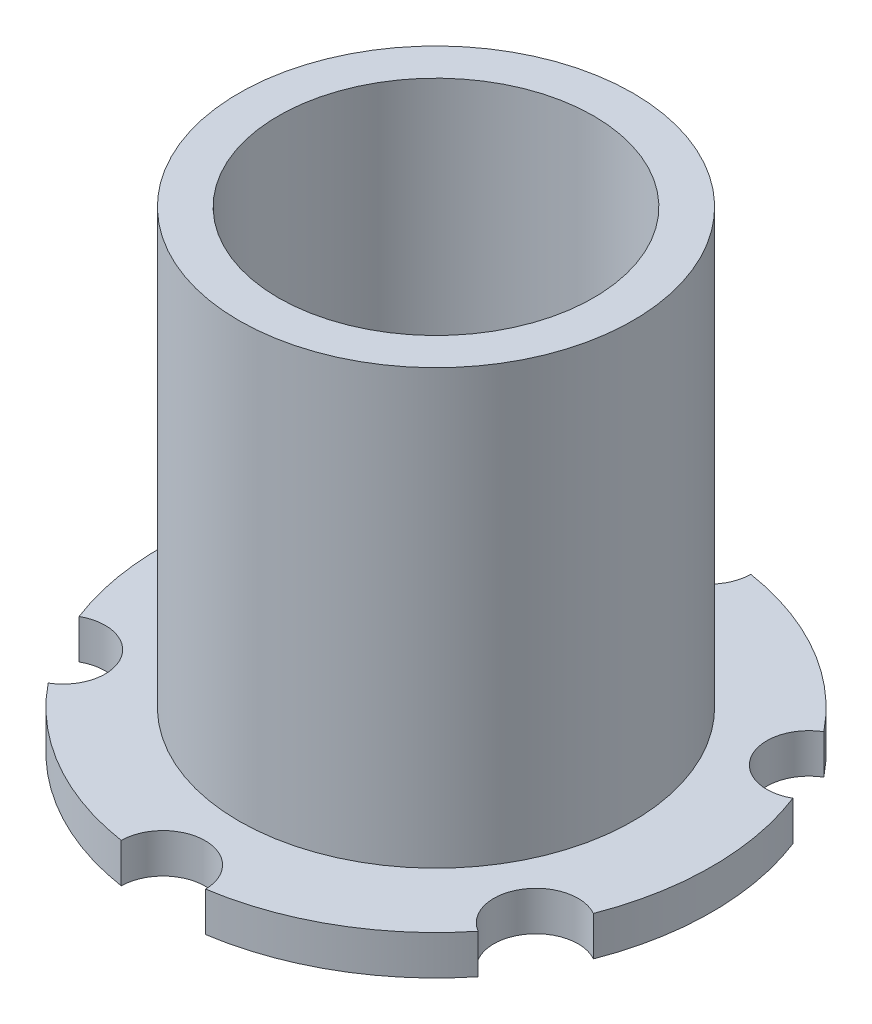
ISO-10303-21;
HEADER;
FILE_DESCRIPTION(('STEP AP214'),'2;1');
FILE_NAME('part.step','',(''),(''),'','','');
FILE_SCHEMA(('AUTOMOTIVE_DESIGN { 1 0 10303 214 1 1 1 1 }'));
ENDSEC;
DATA;
#1=APPLICATION_CONTEXT('core data for automotive mechanical design processes');
#2=APPLICATION_PROTOCOL_DEFINITION('international standard','automotive_design',2000,#1);
#3=PRODUCT_CONTEXT('',#1,'mechanical');
#4=PRODUCT('Part','Part','',(#3));
#5=PRODUCT_RELATED_PRODUCT_CATEGORY('part','',(#4));
#6=PRODUCT_DEFINITION_FORMATION('','',#4);
#7=PRODUCT_DEFINITION_CONTEXT('part definition',#1,'design');
#8=PRODUCT_DEFINITION('design','',#6,#7);
#9=PRODUCT_DEFINITION_SHAPE('','',#8);
#10=(LENGTH_UNIT() NAMED_UNIT(*) SI_UNIT(.MILLI.,.METRE.));
#11=(NAMED_UNIT(*) PLANE_ANGLE_UNIT() SI_UNIT($,.RADIAN.));
#12=(NAMED_UNIT(*) SI_UNIT($,.STERADIAN.) SOLID_ANGLE_UNIT());
#13=UNCERTAINTY_MEASURE_WITH_UNIT(LENGTH_MEASURE(1.E-05),#10,'distance_accuracy_value','');
#14=(GEOMETRIC_REPRESENTATION_CONTEXT(3) GLOBAL_UNCERTAINTY_ASSIGNED_CONTEXT((#13)) GLOBAL_UNIT_ASSIGNED_CONTEXT((#10,
#11,#12)) REPRESENTATION_CONTEXT('',''));
#15=CARTESIAN_POINT('',(0.,0.,0.));
#16=DIRECTION('',(0.,0.,1.));
#17=DIRECTION('',(1.,0.,0.));
#18=AXIS2_PLACEMENT_3D('',#15,#16,#17);
#19=CARTESIAN_POINT('',(0.,1.5875,0.));
#20=DIRECTION('',(0.,-1.,0.));
#21=DIRECTION('',(0.,0.,-1.));
#22=AXIS2_PLACEMENT_3D('',#19,#20,#21);
#23=CYLINDRICAL_SURFACE('',#22,11.1125);
#24=CARTESIAN_POINT('',(0.,0.,0.));
#25=DIRECTION('',(0.,1.,0.));
#26=DIRECTION('',(0.,0.,1.));
#27=AXIS2_PLACEMENT_3D('',#24,#25,#26);
#28=CIRCLE('',#27,11.1125);
#29=CARTESIAN_POINT('',(1.69990162543925,0.,10.9817116477273));
#30=VERTEX_POINT('',#29);
#31=CARTESIAN_POINT('',(8.66049045124758,0.,6.96301381542859));
#32=VERTEX_POINT('',#31);
#33=EDGE_CURVE('E130',#30,#32,#28,.T.);
#34=ORIENTED_EDGE('',*,*,#33,.T.);
#35=DIRECTION('',(0.,-1.,0.));
#36=VECTOR('',#35,1.);
#37=CARTESIAN_POINT('',(8.66049045124758,9.52500000000001,6.96301381542859));
#38=LINE('',#37,#36);
#39=CARTESIAN_POINT('',(8.66049045124758,1.5875,6.96301381542859));
#40=VERTEX_POINT('',#39);
#41=EDGE_CURVE('E11',#32,#40,#38,.F.);
#42=ORIENTED_EDGE('',*,*,#41,.T.);
#43=CARTESIAN_POINT('',(0.,1.5875,0.));
#44=DIRECTION('',(0.,1.,0.));
#45=DIRECTION('',(0.,0.,1.));
#46=AXIS2_PLACEMENT_3D('',#43,#44,#45);
#47=CIRCLE('',#46,11.1125);
#48=CARTESIAN_POINT('',(1.69990162543925,1.5875,10.9817116477273));
#49=VERTEX_POINT('',#48);
#50=EDGE_CURVE('E140',#49,#40,#47,.T.);
#51=ORIENTED_EDGE('',*,*,#50,.F.);
#52=DIRECTION('',(0.,-1.,0.));
#53=VECTOR('',#52,1.);
#54=CARTESIAN_POINT('',(1.69990162543925,9.52500000000001,10.9817116477273));
#55=LINE('',#54,#53);
#56=EDGE_CURVE('E134',#49,#30,#55,.T.);
#57=ORIENTED_EDGE('',*,*,#56,.T.);
#58=EDGE_LOOP('',(#34,#42,#51,#57));
#59=FACE_BOUND('',#58,.T.);
#60=ADVANCED_FACE('F32',(#59),#23,.T.);
#61=CARTESIAN_POINT('',(10.3603920766869,1.5875,4.01869783229891));
#62=VERTEX_POINT('',#61);
#63=CARTESIAN_POINT('',(10.360392076687,1.5875,-4.01869783229869));
#64=VERTEX_POINT('',#63);
#65=EDGE_CURVE('E161',#62,#64,#47,.T.);
#66=ORIENTED_EDGE('',*,*,#65,.F.);
#67=DIRECTION('',(0.,-1.,0.));
#68=VECTOR('',#67,1.);
#69=CARTESIAN_POINT('',(10.3603920766869,9.52500000000001,4.01869783229891));
#70=LINE('',#69,#68);
#71=CARTESIAN_POINT('',(10.3603920766869,0.,4.01869783229891));
#72=VERTEX_POINT('',#71);
#73=EDGE_CURVE('E40',#62,#72,#70,.T.);
#74=ORIENTED_EDGE('',*,*,#73,.T.);
#75=CARTESIAN_POINT('',(10.360392076687,0.,-4.01869783229869));
#76=VERTEX_POINT('',#75);
#77=EDGE_CURVE('E54',#72,#76,#28,.T.);
#78=ORIENTED_EDGE('',*,*,#77,.T.);
#79=DIRECTION('',(0.,-1.,0.));
#80=VECTOR('',#79,1.);
#81=CARTESIAN_POINT('',(10.360392076687,9.52500000000001,-4.01869783229869));
#82=LINE('',#81,#80);
#83=EDGE_CURVE('E214',#76,#64,#82,.F.);
#84=ORIENTED_EDGE('',*,*,#83,.T.);
#85=EDGE_LOOP('',(#66,#74,#78,#84));
#86=FACE_BOUND('',#85,.T.);
#87=ADVANCED_FACE('F206',(#86),#23,.T.);
#88=CARTESIAN_POINT('',(0.,0.,0.));
#89=DIRECTION('',(0.,1.,0.));
#90=DIRECTION('',(0.,0.,1.));
#91=AXIS2_PLACEMENT_3D('',#88,#89,#90);
#92=PLANE('',#91);
#93=CARTESIAN_POINT('',(0.,0.,0.));
#94=DIRECTION('',(0.,1.,0.));
#95=DIRECTION('',(0.,0.,1.));
#96=AXIS2_PLACEMENT_3D('',#93,#94,#95);
#97=CIRCLE('',#96,6.35);
#98=CARTESIAN_POINT('',(0.,0.,6.35));
#99=VERTEX_POINT('',#98);
#100=EDGE_CURVE('E160',#99,#99,#97,.T.);
#101=ORIENTED_EDGE('',*,*,#100,.T.);
#102=EDGE_LOOP('',(#101));
#103=FACE_BOUND('',#102,.T.);
#104=ORIENTED_EDGE('',*,*,#77,.F.);
#105=CARTESIAN_POINT('',(9.52627944162876,0.,5.50000000000011));
#106=DIRECTION('',(0.,-1.,0.));
#107=DIRECTION('',(0.,0.,-1.));
#108=AXIS2_PLACEMENT_3D('',#105,#106,#107);
#109=CIRCLE('',#108,1.69999999999996);
#110=EDGE_CURVE('E47',#32,#72,#109,.T.);
#111=ORIENTED_EDGE('',*,*,#110,.F.);
#112=ORIENTED_EDGE('',*,*,#33,.F.);
#113=CARTESIAN_POINT('',(0.,0.,11.));
#114=DIRECTION('',(0.,-1.,0.));
#115=DIRECTION('',(0.,0.,-1.));
#116=AXIS2_PLACEMENT_3D('',#113,#114,#115);
#117=CIRCLE('',#116,1.69999999999996);
#118=CARTESIAN_POINT('',(-1.69990162543925,0.,10.9817116477273));
#119=VERTEX_POINT('',#118);
#120=EDGE_CURVE('E157',#119,#30,#117,.T.);
#121=ORIENTED_EDGE('',*,*,#120,.F.);
#122=CARTESIAN_POINT('',(-8.66049045124768,0.,6.96301381542847));
#123=VERTEX_POINT('',#122);
#124=EDGE_CURVE('E137',#123,#119,#28,.T.);
#125=ORIENTED_EDGE('',*,*,#124,.F.);
#126=CARTESIAN_POINT('',(-9.52627944162884,0.,5.49999999999998));
#127=DIRECTION('',(0.,-1.,0.));
#128=DIRECTION('',(0.,0.,-1.));
#129=AXIS2_PLACEMENT_3D('',#126,#127,#128);
#130=CIRCLE('',#129,1.69999999999996);
#131=CARTESIAN_POINT('',(-10.3603920766869,0.,4.01869783229876));
#132=VERTEX_POINT('',#131);
#133=EDGE_CURVE('E195',#132,#123,#130,.T.);
#134=ORIENTED_EDGE('',*,*,#133,.F.);
#135=CARTESIAN_POINT('',(-10.3603920766869,0.,-4.01869783229883));
#136=VERTEX_POINT('',#135);
#137=EDGE_CURVE('E143',#136,#132,#28,.T.);
#138=ORIENTED_EDGE('',*,*,#137,.F.);
#139=CARTESIAN_POINT('',(-9.5262794416288,0.,-5.50000000000004));
#140=DIRECTION('',(0.,-1.,0.));
#141=DIRECTION('',(0.,0.,-1.));
#142=AXIS2_PLACEMENT_3D('',#139,#140,#141);
#143=CIRCLE('',#142,1.69999999999996);
#144=CARTESIAN_POINT('',(-8.66049045124763,0.,-6.96301381542853));
#145=VERTEX_POINT('',#144);
#146=EDGE_CURVE('E226',#145,#136,#143,.T.);
#147=ORIENTED_EDGE('',*,*,#146,.F.);
#148=CARTESIAN_POINT('',(-1.69990162543925,0.,-10.9817116477273));
#149=VERTEX_POINT('',#148);
#150=EDGE_CURVE('E150',#149,#145,#28,.T.);
#151=ORIENTED_EDGE('',*,*,#150,.F.);
#152=CARTESIAN_POINT('',(0.,0.,-11.));
#153=DIRECTION('',(0.,-1.,0.));
#154=DIRECTION('',(0.,0.,-1.));
#155=AXIS2_PLACEMENT_3D('',#152,#153,#154);
#156=CIRCLE('',#155,1.69999999999996);
#157=CARTESIAN_POINT('',(1.69990162543925,0.,-10.9817116477273));
#158=VERTEX_POINT('',#157);
#159=EDGE_CURVE('E216',#158,#149,#156,.T.);
#160=ORIENTED_EDGE('',*,*,#159,.F.);
#161=CARTESIAN_POINT('',(8.66049045124773,0.,-6.96301381542841));
#162=VERTEX_POINT('',#161);
#163=EDGE_CURVE('E141',#162,#158,#28,.T.);
#164=ORIENTED_EDGE('',*,*,#163,.F.);
#165=CARTESIAN_POINT('',(9.52627944162887,0.,-5.49999999999991));
#166=DIRECTION('',(0.,-1.,0.));
#167=DIRECTION('',(0.,0.,-1.));
#168=AXIS2_PLACEMENT_3D('',#165,#166,#167);
#169=CIRCLE('',#168,1.69999999999996);
#170=EDGE_CURVE('E207',#76,#162,#169,.T.);
#171=ORIENTED_EDGE('',*,*,#170,.F.);
#172=EDGE_LOOP('',(#104,#111,#112,#121,#125,#134,#138,#147,#151,#160,#164,#171));
#173=FACE_BOUND('',#172,.T.);
#174=ADVANCED_FACE('F128',(#103,#173),#92,.F.);
#175=CARTESIAN_POINT('',(8.66049045124773,1.5875,-6.96301381542841));
#176=VERTEX_POINT('',#175);
#177=CARTESIAN_POINT('',(1.69990162543925,1.5875,-10.9817116477273));
#178=VERTEX_POINT('',#177);
#179=EDGE_CURVE('E167',#176,#178,#47,.T.);
#180=ORIENTED_EDGE('',*,*,#179,.F.);
#181=DIRECTION('',(0.,-1.,0.));
#182=VECTOR('',#181,1.);
#183=CARTESIAN_POINT('',(8.66049045124773,9.52500000000001,-6.96301381542841));
#184=LINE('',#183,#182);
#185=EDGE_CURVE('E209',#176,#162,#184,.T.);
#186=ORIENTED_EDGE('',*,*,#185,.T.);
#187=ORIENTED_EDGE('',*,*,#163,.T.);
#188=DIRECTION('',(0.,-1.,0.));
#189=VECTOR('',#188,1.);
#190=CARTESIAN_POINT('',(1.69990162543925,9.52500000000001,-10.9817116477273));
#191=LINE('',#190,#189);
#192=EDGE_CURVE('E223',#158,#178,#191,.F.);
#193=ORIENTED_EDGE('',*,*,#192,.T.);
#194=EDGE_LOOP('',(#180,#186,#187,#193));
#195=FACE_BOUND('',#194,.T.);
#196=ADVANCED_FACE('F263',(#195),#23,.T.);
#197=CARTESIAN_POINT('',(-1.69990162543925,1.5875,-10.9817116477273));
#198=VERTEX_POINT('',#197);
#199=CARTESIAN_POINT('',(-8.66049045124763,1.5875,-6.96301381542853));
#200=VERTEX_POINT('',#199);
#201=EDGE_CURVE('E171',#198,#200,#47,.T.);
#202=ORIENTED_EDGE('',*,*,#201,.F.);
#203=DIRECTION('',(0.,-1.,0.));
#204=VECTOR('',#203,1.);
#205=CARTESIAN_POINT('',(-1.69990162543925,9.52500000000001,-10.9817116477273));
#206=LINE('',#205,#204);
#207=EDGE_CURVE('E220',#198,#149,#206,.T.);
#208=ORIENTED_EDGE('',*,*,#207,.T.);
#209=ORIENTED_EDGE('',*,*,#150,.T.);
#210=DIRECTION('',(0.,-1.,0.));
#211=VECTOR('',#210,1.);
#212=CARTESIAN_POINT('',(-8.66049045124763,9.52500000000001,-6.96301381542853));
#213=LINE('',#212,#211);
#214=EDGE_CURVE('E230',#145,#200,#213,.F.);
#215=ORIENTED_EDGE('',*,*,#214,.T.);
#216=EDGE_LOOP('',(#202,#208,#209,#215));
#217=FACE_BOUND('',#216,.T.);
#218=ADVANCED_FACE('F255',(#217),#23,.T.);
#219=CARTESIAN_POINT('',(-10.3603920766869,1.5875,-4.01869783229883));
#220=VERTEX_POINT('',#219);
#221=CARTESIAN_POINT('',(-10.3603920766869,1.5875,4.01869783229876));
#222=VERTEX_POINT('',#221);
#223=EDGE_CURVE('E138',#220,#222,#47,.T.);
#224=ORIENTED_EDGE('',*,*,#223,.F.);
#225=DIRECTION('',(0.,-1.,0.));
#226=VECTOR('',#225,1.);
#227=CARTESIAN_POINT('',(-10.3603920766869,9.52500000000001,-4.01869783229883));
#228=LINE('',#227,#226);
#229=EDGE_CURVE('E228',#220,#136,#228,.T.);
#230=ORIENTED_EDGE('',*,*,#229,.T.);
#231=ORIENTED_EDGE('',*,*,#137,.T.);
#232=DIRECTION('',(0.,-1.,0.));
#233=VECTOR('',#232,1.);
#234=CARTESIAN_POINT('',(-10.3603920766869,9.52500000000001,4.01869783229876));
#235=LINE('',#234,#233);
#236=EDGE_CURVE('E192',#132,#222,#235,.F.);
#237=ORIENTED_EDGE('',*,*,#236,.T.);
#238=EDGE_LOOP('',(#224,#230,#231,#237));
#239=FACE_BOUND('',#238,.T.);
#240=ADVANCED_FACE('F197',(#239),#23,.T.);
#241=CARTESIAN_POINT('',(0.,19.05,0.));
#242=DIRECTION('',(0.,1.,0.));
#243=DIRECTION('',(0.,0.,1.));
#244=AXIS2_PLACEMENT_3D('',#241,#242,#243);
#245=PLANE('',#244);
#246=CARTESIAN_POINT('',(0.,19.05,0.));
#247=DIRECTION('',(0.,1.,0.));
#248=DIRECTION('',(0.,0.,1.));
#249=AXIS2_PLACEMENT_3D('',#246,#247,#248);
#250=CIRCLE('',#249,7.9375);
#251=CARTESIAN_POINT('',(0.,19.05,7.9375));
#252=VERTEX_POINT('',#251);
#253=EDGE_CURVE('E237',#252,#252,#250,.T.);
#254=ORIENTED_EDGE('',*,*,#253,.T.);
#255=EDGE_LOOP('',(#254));
#256=FACE_BOUND('',#255,.T.);
#257=CARTESIAN_POINT('',(0.,19.05,0.));
#258=DIRECTION('',(0.,1.,0.));
#259=DIRECTION('',(0.,0.,1.));
#260=AXIS2_PLACEMENT_3D('',#257,#258,#259);
#261=CIRCLE('',#260,6.35);
#262=CARTESIAN_POINT('',(0.,19.05,6.35));
#263=VERTEX_POINT('',#262);
#264=EDGE_CURVE('E165',#263,#263,#261,.T.);
#265=ORIENTED_EDGE('',*,*,#264,.F.);
#266=EDGE_LOOP('',(#265));
#267=FACE_BOUND('',#266,.T.);
#268=ADVANCED_FACE('F247',(#256,#267),#245,.T.);
#269=CARTESIAN_POINT('',(0.,19.05,0.));
#270=DIRECTION('',(0.,-1.,0.));
#271=DIRECTION('',(0.,0.,-1.));
#272=AXIS2_PLACEMENT_3D('',#269,#270,#271);
#273=CYLINDRICAL_SURFACE('',#272,7.9375);
#274=CARTESIAN_POINT('',(0.,1.5875,0.));
#275=DIRECTION('',(0.,1.,0.));
#276=DIRECTION('',(0.,0.,1.));
#277=AXIS2_PLACEMENT_3D('',#274,#275,#276);
#278=CIRCLE('',#277,7.9375);
#279=CARTESIAN_POINT('',(0.,1.5875,7.9375));
#280=VERTEX_POINT('',#279);
#281=EDGE_CURVE('E144',#280,#280,#278,.T.);
#282=ORIENTED_EDGE('',*,*,#281,.T.);
#283=EDGE_LOOP('',(#282));
#284=FACE_BOUND('',#283,.T.);
#285=ORIENTED_EDGE('',*,*,#253,.F.);
#286=EDGE_LOOP('',(#285));
#287=FACE_BOUND('',#286,.T.);
#288=ADVANCED_FACE('F34',(#284,#287),#273,.T.);
#289=CARTESIAN_POINT('',(0.,19.05,0.));
#290=DIRECTION('',(0.,-1.,0.));
#291=DIRECTION('',(0.,0.,-1.));
#292=AXIS2_PLACEMENT_3D('',#289,#290,#291);
#293=CYLINDRICAL_SURFACE('',#292,6.35);
#294=ORIENTED_EDGE('',*,*,#264,.T.);
#295=EDGE_LOOP('',(#294));
#296=FACE_BOUND('',#295,.T.);
#297=ORIENTED_EDGE('',*,*,#100,.F.);
#298=EDGE_LOOP('',(#297));
#299=FACE_BOUND('',#298,.T.);
#300=ADVANCED_FACE('F244',(#296,#299),#293,.F.);
#301=CARTESIAN_POINT('',(0.,1.5875,0.));
#302=DIRECTION('',(0.,1.,0.));
#303=DIRECTION('',(0.,0.,1.));
#304=AXIS2_PLACEMENT_3D('',#301,#302,#303);
#305=PLANE('',#304);
#306=CARTESIAN_POINT('',(9.52627944162876,1.5875,5.50000000000011));
#307=DIRECTION('',(0.,1.,0.));
#308=DIRECTION('',(0.,0.,1.));
#309=AXIS2_PLACEMENT_3D('',#306,#307,#308);
#310=CIRCLE('',#309,1.69999999999996);
#311=EDGE_CURVE('E121',#62,#40,#310,.T.);
#312=ORIENTED_EDGE('',*,*,#311,.F.);
#313=ORIENTED_EDGE('',*,*,#65,.T.);
#314=CARTESIAN_POINT('',(9.52627944162887,1.5875,-5.49999999999991));
#315=DIRECTION('',(0.,1.,0.));
#316=DIRECTION('',(0.,0.,1.));
#317=AXIS2_PLACEMENT_3D('',#314,#315,#316);
#318=CIRCLE('',#317,1.69999999999996);
#319=EDGE_CURVE('E200',#176,#64,#318,.T.);
#320=ORIENTED_EDGE('',*,*,#319,.F.);
#321=ORIENTED_EDGE('',*,*,#179,.T.);
#322=CARTESIAN_POINT('',(0.,1.5875,-11.));
#323=DIRECTION('',(0.,1.,0.));
#324=DIRECTION('',(0.,0.,1.));
#325=AXIS2_PLACEMENT_3D('',#322,#323,#324);
#326=CIRCLE('',#325,1.69999999999996);
#327=EDGE_CURVE('E218',#198,#178,#326,.T.);
#328=ORIENTED_EDGE('',*,*,#327,.F.);
#329=ORIENTED_EDGE('',*,*,#201,.T.);
#330=CARTESIAN_POINT('',(-9.5262794416288,1.5875,-5.50000000000004));
#331=DIRECTION('',(0.,1.,0.));
#332=DIRECTION('',(0.,0.,1.));
#333=AXIS2_PLACEMENT_3D('',#330,#331,#332);
#334=CIRCLE('',#333,1.69999999999996);
#335=EDGE_CURVE('E185',#220,#200,#334,.T.);
#336=ORIENTED_EDGE('',*,*,#335,.F.);
#337=ORIENTED_EDGE('',*,*,#223,.T.);
#338=CARTESIAN_POINT('',(-9.52627944162884,1.5875,5.49999999999998));
#339=DIRECTION('',(0.,1.,0.));
#340=DIRECTION('',(0.,0.,1.));
#341=AXIS2_PLACEMENT_3D('',#338,#339,#340);
#342=CIRCLE('',#341,1.69999999999996);
#343=CARTESIAN_POINT('',(-8.66049045124768,1.5875,6.96301381542847));
#344=VERTEX_POINT('',#343);
#345=EDGE_CURVE('E183',#344,#222,#342,.T.);
#346=ORIENTED_EDGE('',*,*,#345,.F.);
#347=CARTESIAN_POINT('',(-1.69990162543925,1.5875,10.9817116477273));
#348=VERTEX_POINT('',#347);
#349=EDGE_CURVE('E135',#344,#348,#47,.T.);
#350=ORIENTED_EDGE('',*,*,#349,.T.);
#351=CARTESIAN_POINT('',(0.,1.5875,11.));
#352=DIRECTION('',(0.,1.,0.));
#353=DIRECTION('',(0.,0.,1.));
#354=AXIS2_PLACEMENT_3D('',#351,#352,#353);
#355=CIRCLE('',#354,1.69999999999996);
#356=EDGE_CURVE('E152',#49,#348,#355,.T.);
#357=ORIENTED_EDGE('',*,*,#356,.F.);
#358=ORIENTED_EDGE('',*,*,#50,.T.);
#359=EDGE_LOOP('',(#312,#313,#320,#321,#328,#329,#336,#337,#346,#350,#357,#358));
#360=FACE_BOUND('',#359,.T.);
#361=ORIENTED_EDGE('',*,*,#281,.F.);
#362=EDGE_LOOP('',(#361));
#363=FACE_BOUND('',#362,.T.);
#364=ADVANCED_FACE('F181',(#360,#363),#305,.T.);
#365=ORIENTED_EDGE('',*,*,#349,.F.);
#366=DIRECTION('',(0.,-1.,0.));
#367=VECTOR('',#366,1.);
#368=CARTESIAN_POINT('',(-8.66049045124768,9.52500000000001,6.96301381542847));
#369=LINE('',#368,#367);
#370=EDGE_CURVE('E194',#344,#123,#369,.T.);
#371=ORIENTED_EDGE('',*,*,#370,.T.);
#372=ORIENTED_EDGE('',*,*,#124,.T.);
#373=DIRECTION('',(0.,-1.,0.));
#374=VECTOR('',#373,1.);
#375=CARTESIAN_POINT('',(-1.69990162543925,9.52500000000001,10.9817116477273));
#376=LINE('',#375,#374);
#377=EDGE_CURVE('E202',#119,#348,#376,.F.);
#378=ORIENTED_EDGE('',*,*,#377,.T.);
#379=EDGE_LOOP('',(#365,#371,#372,#378));
#380=FACE_BOUND('',#379,.T.);
#381=ADVANCED_FACE('F236',(#380),#23,.T.);
#382=CARTESIAN_POINT('',(0.,0.,11.));
#383=DIRECTION('',(0.,-1.,0.));
#384=DIRECTION('',(0.,0.,-1.));
#385=AXIS2_PLACEMENT_3D('',#382,#383,#384);
#386=CYLINDRICAL_SURFACE('',#385,1.69999999999996);
#387=ORIENTED_EDGE('',*,*,#120,.T.);
#388=ORIENTED_EDGE('',*,*,#56,.F.);
#389=ORIENTED_EDGE('',*,*,#356,.T.);
#390=ORIENTED_EDGE('',*,*,#377,.F.);
#391=EDGE_LOOP('',(#387,#388,#389,#390));
#392=FACE_BOUND('',#391,.T.);
#393=ADVANCED_FACE('F234',(#392),#386,.F.);
#394=CARTESIAN_POINT('',(-9.52627944162884,0.,5.49999999999998));
#395=DIRECTION('',(0.,-1.,0.));
#396=DIRECTION('',(0.,0.,-1.));
#397=AXIS2_PLACEMENT_3D('',#394,#395,#396);
#398=CYLINDRICAL_SURFACE('',#397,1.69999999999996);
#399=ORIENTED_EDGE('',*,*,#133,.T.);
#400=ORIENTED_EDGE('',*,*,#370,.F.);
#401=ORIENTED_EDGE('',*,*,#345,.T.);
#402=ORIENTED_EDGE('',*,*,#236,.F.);
#403=EDGE_LOOP('',(#399,#400,#401,#402));
#404=FACE_BOUND('',#403,.T.);
#405=ADVANCED_FACE('F191',(#404),#398,.F.);
#406=CARTESIAN_POINT('',(-9.5262794416288,0.,-5.50000000000004));
#407=DIRECTION('',(0.,-1.,0.));
#408=DIRECTION('',(0.,0.,-1.));
#409=AXIS2_PLACEMENT_3D('',#406,#407,#408);
#410=CYLINDRICAL_SURFACE('',#409,1.69999999999996);
#411=ORIENTED_EDGE('',*,*,#146,.T.);
#412=ORIENTED_EDGE('',*,*,#229,.F.);
#413=ORIENTED_EDGE('',*,*,#335,.T.);
#414=ORIENTED_EDGE('',*,*,#214,.F.);
#415=EDGE_LOOP('',(#411,#412,#413,#414));
#416=FACE_BOUND('',#415,.T.);
#417=ADVANCED_FACE('F278',(#416),#410,.F.);
#418=CARTESIAN_POINT('',(0.,0.,-11.));
#419=DIRECTION('',(0.,-1.,0.));
#420=DIRECTION('',(0.,0.,-1.));
#421=AXIS2_PLACEMENT_3D('',#418,#419,#420);
#422=CYLINDRICAL_SURFACE('',#421,1.69999999999996);
#423=ORIENTED_EDGE('',*,*,#159,.T.);
#424=ORIENTED_EDGE('',*,*,#207,.F.);
#425=ORIENTED_EDGE('',*,*,#327,.T.);
#426=ORIENTED_EDGE('',*,*,#192,.F.);
#427=EDGE_LOOP('',(#423,#424,#425,#426));
#428=FACE_BOUND('',#427,.T.);
#429=ADVANCED_FACE('F281',(#428),#422,.F.);
#430=CARTESIAN_POINT('',(9.52627944162887,0.,-5.49999999999991));
#431=DIRECTION('',(0.,-1.,0.));
#432=DIRECTION('',(0.,0.,-1.));
#433=AXIS2_PLACEMENT_3D('',#430,#431,#432);
#434=CYLINDRICAL_SURFACE('',#433,1.69999999999996);
#435=ORIENTED_EDGE('',*,*,#170,.T.);
#436=ORIENTED_EDGE('',*,*,#185,.F.);
#437=ORIENTED_EDGE('',*,*,#319,.T.);
#438=ORIENTED_EDGE('',*,*,#83,.F.);
#439=EDGE_LOOP('',(#435,#436,#437,#438));
#440=FACE_BOUND('',#439,.T.);
#441=ADVANCED_FACE('F285',(#440),#434,.F.);
#442=CARTESIAN_POINT('',(9.52627944162876,0.,5.50000000000011));
#443=DIRECTION('',(0.,-1.,0.));
#444=DIRECTION('',(0.,0.,-1.));
#445=AXIS2_PLACEMENT_3D('',#442,#443,#444);
#446=CYLINDRICAL_SURFACE('',#445,1.69999999999996);
#447=ORIENTED_EDGE('',*,*,#110,.T.);
#448=ORIENTED_EDGE('',*,*,#73,.F.);
#449=ORIENTED_EDGE('',*,*,#311,.T.);
#450=ORIENTED_EDGE('',*,*,#41,.F.);
#451=EDGE_LOOP('',(#447,#448,#449,#450));
#452=FACE_BOUND('',#451,.T.);
#453=ADVANCED_FACE('F119',(#452),#446,.F.);
#454=CLOSED_SHELL('',(#60,#87,#174,#196,#218,#240,#268,#288,#300,#364,#381,#393,#405,#417,#429,
#441,#453));
#455=MANIFOLD_SOLID_BREP('B2',#454);
#456=ADVANCED_BREP_SHAPE_REPRESENTATION('',(#18,#455),#14);
#457=SHAPE_DEFINITION_REPRESENTATION(#9,#456);
ENDSEC;
END-ISO-10303-21;
